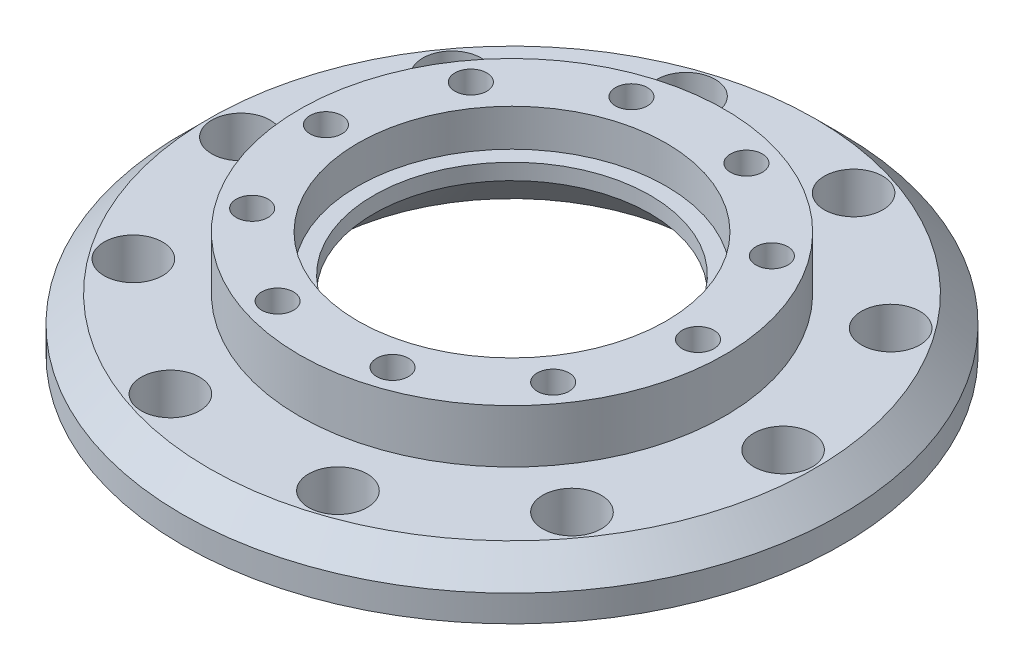
ISO-10303-21;
HEADER;
FILE_DESCRIPTION(('STEP AP214'),'2;1');
FILE_NAME('part.step','',(''),(''),'','','');
FILE_SCHEMA(('AUTOMOTIVE_DESIGN { 1 0 10303 214 1 1 1 1 }'));
ENDSEC;
DATA;
#1=APPLICATION_CONTEXT('core data for automotive mechanical design processes');
#2=APPLICATION_PROTOCOL_DEFINITION('international standard','automotive_design',2000,#1);
#3=PRODUCT_CONTEXT('',#1,'mechanical');
#4=PRODUCT('Part','Part','',(#3));
#5=PRODUCT_RELATED_PRODUCT_CATEGORY('part','',(#4));
#6=PRODUCT_DEFINITION_FORMATION('','',#4);
#7=PRODUCT_DEFINITION_CONTEXT('part definition',#1,'design');
#8=PRODUCT_DEFINITION('design','',#6,#7);
#9=PRODUCT_DEFINITION_SHAPE('','',#8);
#10=(LENGTH_UNIT() NAMED_UNIT(*) SI_UNIT(.MILLI.,.METRE.));
#11=(NAMED_UNIT(*) PLANE_ANGLE_UNIT() SI_UNIT($,.RADIAN.));
#12=(NAMED_UNIT(*) SI_UNIT($,.STERADIAN.) SOLID_ANGLE_UNIT());
#13=UNCERTAINTY_MEASURE_WITH_UNIT(LENGTH_MEASURE(1.E-05),#10,'distance_accuracy_value','');
#14=(GEOMETRIC_REPRESENTATION_CONTEXT(3) GLOBAL_UNCERTAINTY_ASSIGNED_CONTEXT((#13)) GLOBAL_UNIT_ASSIGNED_CONTEXT((#10,
#11,#12)) REPRESENTATION_CONTEXT('',''));
#15=CARTESIAN_POINT('',(0.,0.,0.));
#16=DIRECTION('',(0.,0.,1.));
#17=DIRECTION('',(1.,0.,0.));
#18=AXIS2_PLACEMENT_3D('',#15,#16,#17);
#19=CARTESIAN_POINT('',(0.,10.,0.));
#20=DIRECTION('',(0.,-1.,0.));
#21=DIRECTION('',(0.,0.,-1.));
#22=AXIS2_PLACEMENT_3D('',#19,#20,#21);
#23=CYLINDRICAL_SURFACE('',#22,29.);
#24=CARTESIAN_POINT('',(0.,20.,0.));
#25=DIRECTION('',(0.,1.,0.));
#26=DIRECTION('',(0.,0.,1.));
#27=AXIS2_PLACEMENT_3D('',#24,#25,#26);
#28=CIRCLE('',#27,29.);
#29=CARTESIAN_POINT('',(0.,20.,29.));
#30=VERTEX_POINT('',#29);
#31=EDGE_CURVE('E291',#30,#30,#28,.T.);
#32=ORIENTED_EDGE('',*,*,#31,.T.);
#33=EDGE_LOOP('',(#32));
#34=FACE_BOUND('',#33,.T.);
#35=CARTESIAN_POINT('',(0.,13.,0.));
#36=DIRECTION('',(0.,-1.,0.));
#37=DIRECTION('',(0.,0.,-1.));
#38=AXIS2_PLACEMENT_3D('',#35,#36,#37);
#39=CIRCLE('',#38,29.);
#40=CARTESIAN_POINT('',(0.,13.,-29.));
#41=VERTEX_POINT('',#40);
#42=EDGE_CURVE('E331',#41,#41,#39,.T.);
#43=ORIENTED_EDGE('',*,*,#42,.T.);
#44=EDGE_LOOP('',(#43));
#45=FACE_BOUND('',#44,.T.);
#46=ADVANCED_FACE('F105',(#34,#45),#23,.F.);
#47=CARTESIAN_POINT('',(0.,10.,0.));
#48=DIRECTION('',(0.,-1.,0.));
#49=DIRECTION('',(0.,0.,-1.));
#50=AXIS2_PLACEMENT_3D('',#47,#48,#49);
#51=CYLINDRICAL_SURFACE('',#50,62.);
#52=CARTESIAN_POINT('',(0.,4.99999999999999,0.));
#53=DIRECTION('',(0.,1.,0.));
#54=DIRECTION('',(0.,0.,1.));
#55=AXIS2_PLACEMENT_3D('',#52,#53,#54);
#56=CIRCLE('',#55,62.);
#57=CARTESIAN_POINT('',(0.,4.99999999999999,62.));
#58=VERTEX_POINT('',#57);
#59=EDGE_CURVE('E199',#58,#58,#56,.F.);
#60=ORIENTED_EDGE('',*,*,#59,.T.);
#61=EDGE_LOOP('',(#60));
#62=FACE_BOUND('',#61,.T.);
#63=CARTESIAN_POINT('',(0.,0.,0.));
#64=DIRECTION('',(0.,1.,0.));
#65=DIRECTION('',(0.,0.,1.));
#66=AXIS2_PLACEMENT_3D('',#63,#64,#65);
#67=CIRCLE('',#66,62.);
#68=CARTESIAN_POINT('',(0.,0.,62.));
#69=VERTEX_POINT('',#68);
#70=EDGE_CURVE('E248',#69,#69,#67,.T.);
#71=ORIENTED_EDGE('',*,*,#70,.T.);
#72=EDGE_LOOP('',(#71));
#73=FACE_BOUND('',#72,.T.);
#74=ADVANCED_FACE('F354',(#62,#73),#51,.T.);
#75=CARTESIAN_POINT('',(15.7598667131229,10.,-48.5038823310526));
#76=DIRECTION('',(0.,-1.,0.));
#77=DIRECTION('',(0.,0.,-1.));
#78=AXIS2_PLACEMENT_3D('',#75,#76,#77);
#79=CYLINDRICAL_SURFACE('',#78,5.50000000000001);
#80=CARTESIAN_POINT('',(15.7598667131229,1.00000000000001,-48.5038823310526));
#81=DIRECTION('',(0.,1.,0.));
#82=DIRECTION('',(0.,0.,1.));
#83=AXIS2_PLACEMENT_3D('',#80,#81,#82);
#84=CIRCLE('',#83,5.50000000000001);
#85=CARTESIAN_POINT('',(15.7598667131229,1.00000000000001,-43.0038823310526));
#86=VERTEX_POINT('',#85);
#87=EDGE_CURVE('E147',#86,#86,#84,.F.);
#88=ORIENTED_EDGE('',*,*,#87,.T.);
#89=EDGE_LOOP('',(#88));
#90=FACE_BOUND('',#89,.T.);
#91=CARTESIAN_POINT('',(15.7598667131229,10.,-48.5038823310526));
#92=DIRECTION('',(0.,1.,0.));
#93=DIRECTION('',(0.,0.,1.));
#94=AXIS2_PLACEMENT_3D('',#91,#92,#93);
#95=CIRCLE('',#94,5.50000000000001);
#96=CARTESIAN_POINT('',(15.7598667131229,10.,-43.0038823310526));
#97=VERTEX_POINT('',#96);
#98=EDGE_CURVE('E243',#97,#97,#95,.T.);
#99=ORIENTED_EDGE('',*,*,#98,.T.);
#100=EDGE_LOOP('',(#99));
#101=FACE_BOUND('',#100,.T.);
#102=ADVANCED_FACE('F360',(#90,#101),#79,.F.);
#103=CARTESIAN_POINT('',(-15.7598667131219,10.,-48.503882331053));
#104=DIRECTION('',(0.,-1.,0.));
#105=DIRECTION('',(0.,0.,-1.));
#106=AXIS2_PLACEMENT_3D('',#103,#104,#105);
#107=CYLINDRICAL_SURFACE('',#106,5.5);
#108=CARTESIAN_POINT('',(-15.7598667131219,0.999999999999978,-48.503882331053));
#109=DIRECTION('',(0.,1.,0.));
#110=DIRECTION('',(0.,0.,1.));
#111=AXIS2_PLACEMENT_3D('',#108,#109,#110);
#112=CIRCLE('',#111,5.5);
#113=CARTESIAN_POINT('',(-15.7598667131219,0.999999999999978,-43.003882331053));
#114=VERTEX_POINT('',#113);
#115=EDGE_CURVE('E143',#114,#114,#112,.F.);
#116=ORIENTED_EDGE('',*,*,#115,.T.);
#117=EDGE_LOOP('',(#116));
#118=FACE_BOUND('',#117,.T.);
#119=CARTESIAN_POINT('',(-15.7598667131219,10.,-48.503882331053));
#120=DIRECTION('',(0.,1.,0.));
#121=DIRECTION('',(0.,0.,1.));
#122=AXIS2_PLACEMENT_3D('',#119,#120,#121);
#123=CIRCLE('',#122,5.5);
#124=CARTESIAN_POINT('',(-15.7598667131219,10.,-43.003882331053));
#125=VERTEX_POINT('',#124);
#126=EDGE_CURVE('E256',#125,#125,#123,.T.);
#127=ORIENTED_EDGE('',*,*,#126,.T.);
#128=EDGE_LOOP('',(#127));
#129=FACE_BOUND('',#128,.T.);
#130=ADVANCED_FACE('F370',(#118,#129),#107,.F.);
#131=CARTESIAN_POINT('',(-41.259866713122,10.,-29.9770478669165));
#132=DIRECTION('',(0.,-1.,0.));
#133=DIRECTION('',(0.,0.,-1.));
#134=AXIS2_PLACEMENT_3D('',#131,#132,#133);
#135=CYLINDRICAL_SURFACE('',#134,5.49999999999999);
#136=CARTESIAN_POINT('',(-41.259866713122,0.999999999999982,-29.9770478669165));
#137=DIRECTION('',(0.,1.,0.));
#138=DIRECTION('',(0.,0.,1.));
#139=AXIS2_PLACEMENT_3D('',#136,#137,#138);
#140=CIRCLE('',#139,5.49999999999999);
#141=CARTESIAN_POINT('',(-41.259866713122,0.999999999999982,-24.4770478669165));
#142=VERTEX_POINT('',#141);
#143=EDGE_CURVE('E139',#142,#142,#140,.F.);
#144=ORIENTED_EDGE('',*,*,#143,.T.);
#145=EDGE_LOOP('',(#144));
#146=FACE_BOUND('',#145,.T.);
#147=CARTESIAN_POINT('',(-41.259866713122,10.,-29.9770478669165));
#148=DIRECTION('',(0.,1.,0.));
#149=DIRECTION('',(0.,0.,1.));
#150=AXIS2_PLACEMENT_3D('',#147,#148,#149);
#151=CIRCLE('',#150,5.49999999999999);
#152=CARTESIAN_POINT('',(-41.259866713122,10.,-24.4770478669165));
#153=VERTEX_POINT('',#152);
#154=EDGE_CURVE('E260',#153,#153,#151,.T.);
#155=ORIENTED_EDGE('',*,*,#154,.T.);
#156=EDGE_LOOP('',(#155));
#157=FACE_BOUND('',#156,.T.);
#158=ADVANCED_FACE('F374',(#146,#157),#135,.F.);
#159=CARTESIAN_POINT('',(-51.,10.,-3.56131096562E-13));
#160=DIRECTION('',(0.,-1.,0.));
#161=DIRECTION('',(0.,0.,-1.));
#162=AXIS2_PLACEMENT_3D('',#159,#160,#161);
#163=CYLINDRICAL_SURFACE('',#162,5.5);
#164=CARTESIAN_POINT('',(-51.,1.00000000000002,-3.56131096562E-13));
#165=DIRECTION('',(0.,1.,0.));
#166=DIRECTION('',(0.,0.,1.));
#167=AXIS2_PLACEMENT_3D('',#164,#165,#166);
#168=CIRCLE('',#167,5.5);
#169=CARTESIAN_POINT('',(-51.,1.00000000000002,5.49999999999964));
#170=VERTEX_POINT('',#169);
#171=EDGE_CURVE('E136',#170,#170,#168,.F.);
#172=ORIENTED_EDGE('',*,*,#171,.T.);
#173=EDGE_LOOP('',(#172));
#174=FACE_BOUND('',#173,.T.);
#175=CARTESIAN_POINT('',(-51.,10.,-3.56131096562E-13));
#176=DIRECTION('',(0.,1.,0.));
#177=DIRECTION('',(0.,0.,1.));
#178=AXIS2_PLACEMENT_3D('',#175,#176,#177);
#179=CIRCLE('',#178,5.5);
#180=CARTESIAN_POINT('',(-51.,10.,5.49999999999964));
#181=VERTEX_POINT('',#180);
#182=EDGE_CURVE('E264',#181,#181,#179,.T.);
#183=ORIENTED_EDGE('',*,*,#182,.T.);
#184=EDGE_LOOP('',(#183));
#185=FACE_BOUND('',#184,.T.);
#186=ADVANCED_FACE('F378',(#174,#185),#163,.F.);
#187=CARTESIAN_POINT('',(-41.2598667131225,10.,29.9770478669159));
#188=DIRECTION('',(0.,-1.,0.));
#189=DIRECTION('',(0.,0.,-1.));
#190=AXIS2_PLACEMENT_3D('',#187,#188,#189);
#191=CYLINDRICAL_SURFACE('',#190,5.5);
#192=CARTESIAN_POINT('',(-41.2598667131225,1.00000000000001,29.9770478669159));
#193=DIRECTION('',(0.,1.,0.));
#194=DIRECTION('',(0.,0.,1.));
#195=AXIS2_PLACEMENT_3D('',#192,#193,#194);
#196=CIRCLE('',#195,5.5);
#197=CARTESIAN_POINT('',(-41.2598667131225,1.00000000000001,35.4770478669159));
#198=VERTEX_POINT('',#197);
#199=EDGE_CURVE('E133',#198,#198,#196,.F.);
#200=ORIENTED_EDGE('',*,*,#199,.T.);
#201=EDGE_LOOP('',(#200));
#202=FACE_BOUND('',#201,.T.);
#203=CARTESIAN_POINT('',(-41.2598667131225,10.,29.9770478669159));
#204=DIRECTION('',(0.,1.,0.));
#205=DIRECTION('',(0.,0.,1.));
#206=AXIS2_PLACEMENT_3D('',#203,#204,#205);
#207=CIRCLE('',#206,5.5);
#208=CARTESIAN_POINT('',(-41.2598667131225,10.,35.4770478669159));
#209=VERTEX_POINT('',#208);
#210=EDGE_CURVE('E267',#209,#209,#207,.T.);
#211=ORIENTED_EDGE('',*,*,#210,.T.);
#212=EDGE_LOOP('',(#211));
#213=FACE_BOUND('',#212,.T.);
#214=ADVANCED_FACE('F382',(#202,#213),#191,.F.);
#215=CARTESIAN_POINT('',(-15.7598667131225,10.,48.5038823310528));
#216=DIRECTION('',(0.,-1.,0.));
#217=DIRECTION('',(0.,0.,-1.));
#218=AXIS2_PLACEMENT_3D('',#215,#216,#217);
#219=CYLINDRICAL_SURFACE('',#218,5.49999999999999);
#220=CARTESIAN_POINT('',(-15.7598667131225,0.999999999999982,48.5038823310528));
#221=DIRECTION('',(0.,1.,0.));
#222=DIRECTION('',(0.,0.,1.));
#223=AXIS2_PLACEMENT_3D('',#220,#221,#222);
#224=CIRCLE('',#223,5.49999999999999);
#225=CARTESIAN_POINT('',(-15.7598667131225,0.999999999999982,54.0038823310528));
#226=VERTEX_POINT('',#225);
#227=EDGE_CURVE('E128',#226,#226,#224,.F.);
#228=ORIENTED_EDGE('',*,*,#227,.T.);
#229=EDGE_LOOP('',(#228));
#230=FACE_BOUND('',#229,.T.);
#231=CARTESIAN_POINT('',(-15.7598667131225,10.,48.5038823310528));
#232=DIRECTION('',(0.,1.,0.));
#233=DIRECTION('',(0.,0.,1.));
#234=AXIS2_PLACEMENT_3D('',#231,#232,#233);
#235=CIRCLE('',#234,5.49999999999999);
#236=CARTESIAN_POINT('',(-15.7598667131225,10.,54.0038823310528));
#237=VERTEX_POINT('',#236);
#238=EDGE_CURVE('E270',#237,#237,#235,.T.);
#239=ORIENTED_EDGE('',*,*,#238,.T.);
#240=EDGE_LOOP('',(#239));
#241=FACE_BOUND('',#240,.T.);
#242=ADVANCED_FACE('F386',(#230,#241),#219,.F.);
#243=CARTESIAN_POINT('',(15.7598667131222,10.,48.5038823310529));
#244=DIRECTION('',(0.,-1.,0.));
#245=DIRECTION('',(0.,0.,-1.));
#246=AXIS2_PLACEMENT_3D('',#243,#244,#245);
#247=CYLINDRICAL_SURFACE('',#246,5.5);
#248=CARTESIAN_POINT('',(15.7598667131222,0.999999999999978,48.5038823310529));
#249=DIRECTION('',(0.,1.,0.));
#250=DIRECTION('',(0.,0.,1.));
#251=AXIS2_PLACEMENT_3D('',#248,#249,#250);
#252=CIRCLE('',#251,5.5);
#253=CARTESIAN_POINT('',(15.7598667131222,0.999999999999978,54.0038823310529));
#254=VERTEX_POINT('',#253);
#255=EDGE_CURVE('E121',#254,#254,#252,.F.);
#256=ORIENTED_EDGE('',*,*,#255,.T.);
#257=EDGE_LOOP('',(#256));
#258=FACE_BOUND('',#257,.T.);
#259=CARTESIAN_POINT('',(15.7598667131222,10.,48.5038823310529));
#260=DIRECTION('',(0.,1.,0.));
#261=DIRECTION('',(0.,0.,1.));
#262=AXIS2_PLACEMENT_3D('',#259,#260,#261);
#263=CIRCLE('',#262,5.5);
#264=CARTESIAN_POINT('',(15.7598667131222,10.,54.0038823310529));
#265=VERTEX_POINT('',#264);
#266=EDGE_CURVE('E273',#265,#265,#263,.T.);
#267=ORIENTED_EDGE('',*,*,#266,.T.);
#268=EDGE_LOOP('',(#267));
#269=FACE_BOUND('',#268,.T.);
#270=ADVANCED_FACE('F390',(#258,#269),#247,.F.);
#271=CARTESIAN_POINT('',(41.2598667131223,10.,29.9770478669162));
#272=DIRECTION('',(0.,-1.,0.));
#273=DIRECTION('',(0.,0.,-1.));
#274=AXIS2_PLACEMENT_3D('',#271,#272,#273);
#275=CYLINDRICAL_SURFACE('',#274,5.5);
#276=CARTESIAN_POINT('',(41.2598667131223,1.00000000000001,29.9770478669162));
#277=DIRECTION('',(0.,1.,0.));
#278=DIRECTION('',(0.,0.,1.));
#279=AXIS2_PLACEMENT_3D('',#276,#277,#278);
#280=CIRCLE('',#279,5.5);
#281=CARTESIAN_POINT('',(41.2598667131223,1.00000000000001,35.4770478669162));
#282=VERTEX_POINT('',#281);
#283=EDGE_CURVE('E158',#282,#282,#280,.F.);
#284=ORIENTED_EDGE('',*,*,#283,.T.);
#285=EDGE_LOOP('',(#284));
#286=FACE_BOUND('',#285,.T.);
#287=CARTESIAN_POINT('',(41.2598667131223,10.,29.9770478669162));
#288=DIRECTION('',(0.,1.,0.));
#289=DIRECTION('',(0.,0.,1.));
#290=AXIS2_PLACEMENT_3D('',#287,#288,#289);
#291=CIRCLE('',#290,5.5);
#292=CARTESIAN_POINT('',(41.2598667131223,10.,35.4770478669162));
#293=VERTEX_POINT('',#292);
#294=EDGE_CURVE('E277',#293,#293,#291,.T.);
#295=ORIENTED_EDGE('',*,*,#294,.T.);
#296=EDGE_LOOP('',(#295));
#297=FACE_BOUND('',#296,.T.);
#298=ADVANCED_FACE('F394',(#286,#297),#275,.F.);
#299=CARTESIAN_POINT('',(51.,10.,0.));
#300=DIRECTION('',(0.,-1.,0.));
#301=DIRECTION('',(0.,0.,-1.));
#302=AXIS2_PLACEMENT_3D('',#299,#300,#301);
#303=CYLINDRICAL_SURFACE('',#302,5.5);
#304=CARTESIAN_POINT('',(51.,1.00000000000002,0.));
#305=DIRECTION('',(0.,1.,0.));
#306=DIRECTION('',(0.,0.,1.));
#307=AXIS2_PLACEMENT_3D('',#304,#305,#306);
#308=CIRCLE('',#307,5.5);
#309=CARTESIAN_POINT('',(51.,1.00000000000002,5.5));
#310=VERTEX_POINT('',#309);
#311=EDGE_CURVE('E154',#310,#310,#308,.F.);
#312=ORIENTED_EDGE('',*,*,#311,.T.);
#313=EDGE_LOOP('',(#312));
#314=FACE_BOUND('',#313,.T.);
#315=CARTESIAN_POINT('',(51.,10.,0.));
#316=DIRECTION('',(0.,1.,0.));
#317=DIRECTION('',(0.,0.,1.));
#318=AXIS2_PLACEMENT_3D('',#315,#316,#317);
#319=CIRCLE('',#318,5.5);
#320=CARTESIAN_POINT('',(51.,10.,5.5));
#321=VERTEX_POINT('',#320);
#322=EDGE_CURVE('E281',#321,#321,#319,.T.);
#323=ORIENTED_EDGE('',*,*,#322,.T.);
#324=EDGE_LOOP('',(#323));
#325=FACE_BOUND('',#324,.T.);
#326=ADVANCED_FACE('F398',(#314,#325),#303,.F.);
#327=CARTESIAN_POINT('',(41.2598667131227,10.,-29.9770478669156));
#328=DIRECTION('',(0.,-1.,0.));
#329=DIRECTION('',(0.,0.,-1.));
#330=AXIS2_PLACEMENT_3D('',#327,#328,#329);
#331=CYLINDRICAL_SURFACE('',#330,5.49999999999999);
#332=CARTESIAN_POINT('',(41.2598667131227,0.999999999999982,-29.9770478669156));
#333=DIRECTION('',(0.,1.,0.));
#334=DIRECTION('',(0.,0.,1.));
#335=AXIS2_PLACEMENT_3D('',#332,#333,#334);
#336=CIRCLE('',#335,5.49999999999999);
#337=CARTESIAN_POINT('',(41.2598667131227,0.999999999999982,-24.4770478669156));
#338=VERTEX_POINT('',#337);
#339=EDGE_CURVE('E150',#338,#338,#336,.F.);
#340=ORIENTED_EDGE('',*,*,#339,.T.);
#341=EDGE_LOOP('',(#340));
#342=FACE_BOUND('',#341,.T.);
#343=CARTESIAN_POINT('',(41.2598667131227,10.,-29.9770478669156));
#344=DIRECTION('',(0.,1.,0.));
#345=DIRECTION('',(0.,0.,1.));
#346=AXIS2_PLACEMENT_3D('',#343,#344,#345);
#347=CIRCLE('',#346,5.49999999999999);
#348=CARTESIAN_POINT('',(41.2598667131227,10.,-24.4770478669156));
#349=VERTEX_POINT('',#348);
#350=EDGE_CURVE('E253',#349,#349,#347,.T.);
#351=ORIENTED_EDGE('',*,*,#350,.T.);
#352=EDGE_LOOP('',(#351));
#353=FACE_BOUND('',#352,.T.);
#354=ADVANCED_FACE('F402',(#342,#353),#331,.F.);
#355=CARTESIAN_POINT('',(0.,0.,0.));
#356=DIRECTION('',(0.,1.,0.));
#357=DIRECTION('',(0.,0.,1.));
#358=AXIS2_PLACEMENT_3D('',#355,#356,#357);
#359=PLANE('',#358);
#360=CARTESIAN_POINT('',(0.,0.,0.));
#361=DIRECTION('',(0.,1.,0.));
#362=DIRECTION('',(0.,0.,1.));
#363=AXIS2_PLACEMENT_3D('',#360,#361,#362);
#364=CIRCLE('',#363,36.0000000000001);
#365=CARTESIAN_POINT('',(0.,0.,36.0000000000001));
#366=VERTEX_POINT('',#365);
#367=EDGE_CURVE('E11',#366,#366,#364,.T.);
#368=ORIENTED_EDGE('',*,*,#367,.T.);
#369=EDGE_LOOP('',(#368));
#370=FACE_BOUND('',#369,.T.);
#371=CARTESIAN_POINT('',(41.2598667131223,0.,29.9770478669162));
#372=DIRECTION('',(0.,1.,0.));
#373=DIRECTION('',(0.,0.,1.));
#374=AXIS2_PLACEMENT_3D('',#371,#372,#373);
#375=CIRCLE('',#374,6.50000000000001);
#376=CARTESIAN_POINT('',(41.2598667131223,0.,36.4770478669162));
#377=VERTEX_POINT('',#376);
#378=EDGE_CURVE('E162',#377,#377,#375,.T.);
#379=ORIENTED_EDGE('',*,*,#378,.T.);
#380=EDGE_LOOP('',(#379));
#381=FACE_BOUND('',#380,.T.);
#382=CARTESIAN_POINT('',(51.,0.,0.));
#383=DIRECTION('',(0.,1.,0.));
#384=DIRECTION('',(0.,0.,1.));
#385=AXIS2_PLACEMENT_3D('',#382,#383,#384);
#386=CIRCLE('',#385,6.50000000000001);
#387=CARTESIAN_POINT('',(51.,0.,6.50000000000001));
#388=VERTEX_POINT('',#387);
#389=EDGE_CURVE('E166',#388,#388,#386,.T.);
#390=ORIENTED_EDGE('',*,*,#389,.T.);
#391=EDGE_LOOP('',(#390));
#392=FACE_BOUND('',#391,.T.);
#393=CARTESIAN_POINT('',(41.2598667131227,0.,-29.9770478669156));
#394=DIRECTION('',(0.,1.,0.));
#395=DIRECTION('',(0.,0.,1.));
#396=AXIS2_PLACEMENT_3D('',#393,#394,#395);
#397=CIRCLE('',#396,6.49999999999998);
#398=CARTESIAN_POINT('',(41.2598667131227,0.,-23.4770478669156));
#399=VERTEX_POINT('',#398);
#400=EDGE_CURVE('E170',#399,#399,#397,.T.);
#401=ORIENTED_EDGE('',*,*,#400,.T.);
#402=EDGE_LOOP('',(#401));
#403=FACE_BOUND('',#402,.T.);
#404=CARTESIAN_POINT('',(15.7598667131229,0.,-48.5038823310526));
#405=DIRECTION('',(0.,1.,0.));
#406=DIRECTION('',(0.,0.,1.));
#407=AXIS2_PLACEMENT_3D('',#404,#405,#406);
#408=CIRCLE('',#407,6.50000000000001);
#409=CARTESIAN_POINT('',(15.7598667131229,0.,-42.0038823310526));
#410=VERTEX_POINT('',#409);
#411=EDGE_CURVE('E174',#410,#410,#408,.T.);
#412=ORIENTED_EDGE('',*,*,#411,.T.);
#413=EDGE_LOOP('',(#412));
#414=FACE_BOUND('',#413,.T.);
#415=CARTESIAN_POINT('',(-15.7598667131219,0.,-48.503882331053));
#416=DIRECTION('',(0.,1.,0.));
#417=DIRECTION('',(0.,0.,1.));
#418=AXIS2_PLACEMENT_3D('',#415,#416,#417);
#419=CIRCLE('',#418,6.49999999999998);
#420=CARTESIAN_POINT('',(-15.7598667131219,0.,-42.003882331053));
#421=VERTEX_POINT('',#420);
#422=EDGE_CURVE('E178',#421,#421,#419,.T.);
#423=ORIENTED_EDGE('',*,*,#422,.T.);
#424=EDGE_LOOP('',(#423));
#425=FACE_BOUND('',#424,.T.);
#426=CARTESIAN_POINT('',(-41.259866713122,0.,-29.9770478669165));
#427=DIRECTION('',(0.,1.,0.));
#428=DIRECTION('',(0.,0.,1.));
#429=AXIS2_PLACEMENT_3D('',#426,#427,#428);
#430=CIRCLE('',#429,6.49999999999998);
#431=CARTESIAN_POINT('',(-41.259866713122,0.,-23.4770478669165));
#432=VERTEX_POINT('',#431);
#433=EDGE_CURVE('E182',#432,#432,#430,.T.);
#434=ORIENTED_EDGE('',*,*,#433,.T.);
#435=EDGE_LOOP('',(#434));
#436=FACE_BOUND('',#435,.T.);
#437=CARTESIAN_POINT('',(-51.,0.,-3.56131096562E-13));
#438=DIRECTION('',(0.,1.,0.));
#439=DIRECTION('',(0.,0.,1.));
#440=AXIS2_PLACEMENT_3D('',#437,#438,#439);
#441=CIRCLE('',#440,6.50000000000001);
#442=CARTESIAN_POINT('',(-51.,0.,6.49999999999965));
#443=VERTEX_POINT('',#442);
#444=EDGE_CURVE('E186',#443,#443,#441,.T.);
#445=ORIENTED_EDGE('',*,*,#444,.T.);
#446=EDGE_LOOP('',(#445));
#447=FACE_BOUND('',#446,.T.);
#448=CARTESIAN_POINT('',(-41.2598667131225,0.,29.9770478669159));
#449=DIRECTION('',(0.,1.,0.));
#450=DIRECTION('',(0.,0.,1.));
#451=AXIS2_PLACEMENT_3D('',#448,#449,#450);
#452=CIRCLE('',#451,6.50000000000001);
#453=CARTESIAN_POINT('',(-41.2598667131225,0.,36.4770478669159));
#454=VERTEX_POINT('',#453);
#455=EDGE_CURVE('E189',#454,#454,#452,.T.);
#456=ORIENTED_EDGE('',*,*,#455,.T.);
#457=EDGE_LOOP('',(#456));
#458=FACE_BOUND('',#457,.T.);
#459=CARTESIAN_POINT('',(-15.7598667131225,0.,48.5038823310528));
#460=DIRECTION('',(0.,1.,0.));
#461=DIRECTION('',(0.,0.,1.));
#462=AXIS2_PLACEMENT_3D('',#459,#460,#461);
#463=CIRCLE('',#462,6.49999999999998);
#464=CARTESIAN_POINT('',(-15.7598667131225,0.,55.0038823310528));
#465=VERTEX_POINT('',#464);
#466=EDGE_CURVE('E192',#465,#465,#463,.T.);
#467=ORIENTED_EDGE('',*,*,#466,.T.);
#468=EDGE_LOOP('',(#467));
#469=FACE_BOUND('',#468,.T.);
#470=CARTESIAN_POINT('',(15.7598667131222,0.,48.5038823310529));
#471=DIRECTION('',(0.,1.,0.));
#472=DIRECTION('',(0.,0.,1.));
#473=AXIS2_PLACEMENT_3D('',#470,#471,#472);
#474=CIRCLE('',#473,6.49999999999998);
#475=CARTESIAN_POINT('',(15.7598667131222,0.,55.0038823310529));
#476=VERTEX_POINT('',#475);
#477=EDGE_CURVE('E195',#476,#476,#474,.T.);
#478=ORIENTED_EDGE('',*,*,#477,.T.);
#479=EDGE_LOOP('',(#478));
#480=FACE_BOUND('',#479,.T.);
#481=ORIENTED_EDGE('',*,*,#70,.F.);
#482=EDGE_LOOP('',(#481));
#483=FACE_BOUND('',#482,.T.);
#484=ADVANCED_FACE('F365',(#370,#381,#392,#403,#414,#425,#436,#447,#458,#469,#480,#483),#359,.F.);
#485=CARTESIAN_POINT('',(0.,10.,0.));
#486=DIRECTION('',(0.,1.,0.));
#487=DIRECTION('',(0.,0.,1.));
#488=AXIS2_PLACEMENT_3D('',#485,#486,#487);
#489=PLANE('',#488);
#490=CARTESIAN_POINT('',(0.,10.,0.));
#491=DIRECTION('',(0.,1.,0.));
#492=DIRECTION('',(0.,0.,1.));
#493=AXIS2_PLACEMENT_3D('',#490,#491,#492);
#494=CIRCLE('',#493,57.);
#495=CARTESIAN_POINT('',(0.,10.,57.));
#496=VERTEX_POINT('',#495);
#497=EDGE_CURVE('E203',#496,#496,#494,.T.);
#498=ORIENTED_EDGE('',*,*,#497,.T.);
#499=EDGE_LOOP('',(#498));
#500=FACE_BOUND('',#499,.T.);
#501=CARTESIAN_POINT('',(0.,10.,0.));
#502=DIRECTION('',(0.,1.,0.));
#503=DIRECTION('',(0.,0.,1.));
#504=AXIS2_PLACEMENT_3D('',#501,#502,#503);
#505=CIRCLE('',#504,40.);
#506=CARTESIAN_POINT('',(0.,10.,40.));
#507=VERTEX_POINT('',#506);
#508=EDGE_CURVE('E244',#507,#507,#505,.F.);
#509=ORIENTED_EDGE('',*,*,#508,.T.);
#510=EDGE_LOOP('',(#509));
#511=FACE_BOUND('',#510,.T.);
#512=ORIENTED_EDGE('',*,*,#350,.F.);
#513=EDGE_LOOP('',(#512));
#514=FACE_BOUND('',#513,.T.);
#515=ORIENTED_EDGE('',*,*,#322,.F.);
#516=EDGE_LOOP('',(#515));
#517=FACE_BOUND('',#516,.T.);
#518=ORIENTED_EDGE('',*,*,#294,.F.);
#519=EDGE_LOOP('',(#518));
#520=FACE_BOUND('',#519,.T.);
#521=ORIENTED_EDGE('',*,*,#266,.F.);
#522=EDGE_LOOP('',(#521));
#523=FACE_BOUND('',#522,.T.);
#524=ORIENTED_EDGE('',*,*,#238,.F.);
#525=EDGE_LOOP('',(#524));
#526=FACE_BOUND('',#525,.T.);
#527=ORIENTED_EDGE('',*,*,#210,.F.);
#528=EDGE_LOOP('',(#527));
#529=FACE_BOUND('',#528,.T.);
#530=ORIENTED_EDGE('',*,*,#182,.F.);
#531=EDGE_LOOP('',(#530));
#532=FACE_BOUND('',#531,.T.);
#533=ORIENTED_EDGE('',*,*,#154,.F.);
#534=EDGE_LOOP('',(#533));
#535=FACE_BOUND('',#534,.T.);
#536=ORIENTED_EDGE('',*,*,#126,.F.);
#537=EDGE_LOOP('',(#536));
#538=FACE_BOUND('',#537,.T.);
#539=ORIENTED_EDGE('',*,*,#98,.F.);
#540=EDGE_LOOP('',(#539));
#541=FACE_BOUND('',#540,.T.);
#542=ADVANCED_FACE('F490',(#500,#511,#514,#517,#520,#523,#526,#529,#532,#535,#538,#541),#489,.T.);
#543=CARTESIAN_POINT('',(35.,20.,0.));
#544=DIRECTION('',(0.,-1.,0.));
#545=DIRECTION('',(0.,0.,-1.));
#546=AXIS2_PLACEMENT_3D('',#543,#544,#545);
#547=CYLINDRICAL_SURFACE('',#546,3.);
#548=CARTESIAN_POINT('',(35.,15.,0.));
#549=DIRECTION('',(0.,1.,0.));
#550=DIRECTION('',(0.,0.,1.));
#551=AXIS2_PLACEMENT_3D('',#548,#549,#550);
#552=CIRCLE('',#551,3.);
#553=CARTESIAN_POINT('',(35.,15.,3.));
#554=VERTEX_POINT('',#553);
#555=EDGE_CURVE('E218',#554,#554,#552,.T.);
#556=ORIENTED_EDGE('',*,*,#555,.F.);
#557=EDGE_LOOP('',(#556));
#558=FACE_BOUND('',#557,.T.);
#559=CARTESIAN_POINT('',(35.,20.,0.));
#560=DIRECTION('',(0.,1.,0.));
#561=DIRECTION('',(0.,0.,1.));
#562=AXIS2_PLACEMENT_3D('',#559,#560,#561);
#563=CIRCLE('',#562,3.);
#564=CARTESIAN_POINT('',(35.,20.,3.));
#565=VERTEX_POINT('',#564);
#566=EDGE_CURVE('E295',#565,#565,#563,.T.);
#567=ORIENTED_EDGE('',*,*,#566,.T.);
#568=EDGE_LOOP('',(#567));
#569=FACE_BOUND('',#568,.T.);
#570=ADVANCED_FACE('F496',(#558,#569),#547,.F.);
#571=CARTESIAN_POINT('',(28.3155948031231,20.,20.5724838302366));
#572=DIRECTION('',(0.,-1.,0.));
#573=DIRECTION('',(0.,0.,-1.));
#574=AXIS2_PLACEMENT_3D('',#571,#572,#573);
#575=CYLINDRICAL_SURFACE('',#574,3.);
#576=CARTESIAN_POINT('',(28.3155948031231,15.,20.5724838302366));
#577=DIRECTION('',(0.,1.,0.));
#578=DIRECTION('',(0.,0.,1.));
#579=AXIS2_PLACEMENT_3D('',#576,#577,#578);
#580=CIRCLE('',#579,3.);
#581=CARTESIAN_POINT('',(28.3155948031231,15.,23.5724838302366));
#582=VERTEX_POINT('',#581);
#583=EDGE_CURVE('E214',#582,#582,#580,.T.);
#584=ORIENTED_EDGE('',*,*,#583,.F.);
#585=EDGE_LOOP('',(#584));
#586=FACE_BOUND('',#585,.T.);
#587=CARTESIAN_POINT('',(28.3155948031231,20.,20.5724838302366));
#588=DIRECTION('',(0.,1.,0.));
#589=DIRECTION('',(0.,0.,1.));
#590=AXIS2_PLACEMENT_3D('',#587,#588,#589);
#591=CIRCLE('',#590,3.);
#592=CARTESIAN_POINT('',(28.3155948031231,20.,23.5724838302366));
#593=VERTEX_POINT('',#592);
#594=EDGE_CURVE('E299',#593,#593,#591,.T.);
#595=ORIENTED_EDGE('',*,*,#594,.T.);
#596=EDGE_LOOP('',(#595));
#597=FACE_BOUND('',#596,.T.);
#598=ADVANCED_FACE('F528',(#586,#597),#575,.F.);
#599=CARTESIAN_POINT('',(10.8155948031231,20.,33.2869780703304));
#600=DIRECTION('',(0.,-1.,0.));
#601=DIRECTION('',(0.,0.,-1.));
#602=AXIS2_PLACEMENT_3D('',#599,#600,#601);
#603=CYLINDRICAL_SURFACE('',#602,3.00000000000001);
#604=CARTESIAN_POINT('',(10.8155948031231,15.,33.2869780703304));
#605=DIRECTION('',(0.,1.,0.));
#606=DIRECTION('',(0.,0.,1.));
#607=AXIS2_PLACEMENT_3D('',#604,#605,#606);
#608=CIRCLE('',#607,3.00000000000001);
#609=CARTESIAN_POINT('',(10.8155948031231,15.,36.2869780703304));
#610=VERTEX_POINT('',#609);
#611=EDGE_CURVE('E210',#610,#610,#608,.T.);
#612=ORIENTED_EDGE('',*,*,#611,.F.);
#613=EDGE_LOOP('',(#612));
#614=FACE_BOUND('',#613,.T.);
#615=CARTESIAN_POINT('',(10.8155948031231,20.,33.2869780703304));
#616=DIRECTION('',(0.,1.,0.));
#617=DIRECTION('',(0.,0.,1.));
#618=AXIS2_PLACEMENT_3D('',#615,#616,#617);
#619=CIRCLE('',#618,3.00000000000001);
#620=CARTESIAN_POINT('',(10.8155948031231,20.,36.2869780703304));
#621=VERTEX_POINT('',#620);
#622=EDGE_CURVE('E303',#621,#621,#619,.T.);
#623=ORIENTED_EDGE('',*,*,#622,.T.);
#624=EDGE_LOOP('',(#623));
#625=FACE_BOUND('',#624,.T.);
#626=ADVANCED_FACE('F561',(#614,#625),#603,.F.);
#627=CARTESIAN_POINT('',(-10.8155948031233,20.,33.2869780703303));
#628=DIRECTION('',(0.,-1.,0.));
#629=DIRECTION('',(0.,0.,-1.));
#630=AXIS2_PLACEMENT_3D('',#627,#628,#629);
#631=CYLINDRICAL_SURFACE('',#630,3.);
#632=CARTESIAN_POINT('',(-10.8155948031233,15.,33.2869780703303));
#633=DIRECTION('',(0.,1.,0.));
#634=DIRECTION('',(0.,0.,1.));
#635=AXIS2_PLACEMENT_3D('',#632,#633,#634);
#636=CIRCLE('',#635,3.);
#637=CARTESIAN_POINT('',(-10.8155948031233,15.,36.2869780703303));
#638=VERTEX_POINT('',#637);
#639=EDGE_CURVE('E207',#638,#638,#636,.T.);
#640=ORIENTED_EDGE('',*,*,#639,.F.);
#641=EDGE_LOOP('',(#640));
#642=FACE_BOUND('',#641,.T.);
#643=CARTESIAN_POINT('',(-10.8155948031233,20.,33.2869780703303));
#644=DIRECTION('',(0.,1.,0.));
#645=DIRECTION('',(0.,0.,1.));
#646=AXIS2_PLACEMENT_3D('',#643,#644,#645);
#647=CIRCLE('',#646,3.);
#648=CARTESIAN_POINT('',(-10.8155948031233,20.,36.2869780703303));
#649=VERTEX_POINT('',#648);
#650=EDGE_CURVE('E307',#649,#649,#647,.T.);
#651=ORIENTED_EDGE('',*,*,#650,.T.);
#652=EDGE_LOOP('',(#651));
#653=FACE_BOUND('',#652,.T.);
#654=ADVANCED_FACE('F557',(#642,#653),#631,.F.);
#655=CARTESIAN_POINT('',(-28.3155948031233,20.,20.5724838302364));
#656=DIRECTION('',(0.,-1.,0.));
#657=DIRECTION('',(0.,0.,-1.));
#658=AXIS2_PLACEMENT_3D('',#655,#656,#657);
#659=CYLINDRICAL_SURFACE('',#658,3.);
#660=CARTESIAN_POINT('',(-28.3155948031233,15.,20.5724838302364));
#661=DIRECTION('',(0.,1.,0.));
#662=DIRECTION('',(0.,0.,1.));
#663=AXIS2_PLACEMENT_3D('',#660,#661,#662);
#664=CIRCLE('',#663,3.);
#665=CARTESIAN_POINT('',(-28.3155948031233,15.,23.5724838302364));
#666=VERTEX_POINT('',#665);
#667=EDGE_CURVE('E240',#666,#666,#664,.T.);
#668=ORIENTED_EDGE('',*,*,#667,.F.);
#669=EDGE_LOOP('',(#668));
#670=FACE_BOUND('',#669,.T.);
#671=CARTESIAN_POINT('',(-28.3155948031233,20.,20.5724838302364));
#672=DIRECTION('',(0.,1.,0.));
#673=DIRECTION('',(0.,0.,1.));
#674=AXIS2_PLACEMENT_3D('',#671,#672,#673);
#675=CIRCLE('',#674,3.);
#676=CARTESIAN_POINT('',(-28.3155948031233,20.,23.5724838302364));
#677=VERTEX_POINT('',#676);
#678=EDGE_CURVE('E310',#677,#677,#675,.T.);
#679=ORIENTED_EDGE('',*,*,#678,.T.);
#680=EDGE_LOOP('',(#679));
#681=FACE_BOUND('',#680,.T.);
#682=ADVANCED_FACE('F553',(#670,#681),#659,.F.);
#683=CARTESIAN_POINT('',(-35.,20.,-2.44403693719019E-13));
#684=DIRECTION('',(0.,-1.,0.));
#685=DIRECTION('',(0.,0.,-1.));
#686=AXIS2_PLACEMENT_3D('',#683,#684,#685);
#687=CYLINDRICAL_SURFACE('',#686,3.);
#688=CARTESIAN_POINT('',(-35.,15.,-2.44403693719019E-13));
#689=DIRECTION('',(0.,1.,0.));
#690=DIRECTION('',(0.,0.,1.));
#691=AXIS2_PLACEMENT_3D('',#688,#689,#690);
#692=CIRCLE('',#691,3.);
#693=CARTESIAN_POINT('',(-35.,15.,2.99999999999976));
#694=VERTEX_POINT('',#693);
#695=EDGE_CURVE('E237',#694,#694,#692,.T.);
#696=ORIENTED_EDGE('',*,*,#695,.F.);
#697=EDGE_LOOP('',(#696));
#698=FACE_BOUND('',#697,.T.);
#699=CARTESIAN_POINT('',(-35.,20.,-2.44403693719019E-13));
#700=DIRECTION('',(0.,1.,0.));
#701=DIRECTION('',(0.,0.,1.));
#702=AXIS2_PLACEMENT_3D('',#699,#700,#701);
#703=CIRCLE('',#702,3.);
#704=CARTESIAN_POINT('',(-35.,20.,2.99999999999976));
#705=VERTEX_POINT('',#704);
#706=EDGE_CURVE('E313',#705,#705,#703,.T.);
#707=ORIENTED_EDGE('',*,*,#706,.T.);
#708=EDGE_LOOP('',(#707));
#709=FACE_BOUND('',#708,.T.);
#710=ADVANCED_FACE('F549',(#698,#709),#687,.F.);
#711=CARTESIAN_POINT('',(-28.315594803123,20.,-20.5724838302368));
#712=DIRECTION('',(0.,-1.,0.));
#713=DIRECTION('',(0.,0.,-1.));
#714=AXIS2_PLACEMENT_3D('',#711,#712,#713);
#715=CYLINDRICAL_SURFACE('',#714,3.);
#716=CARTESIAN_POINT('',(-28.315594803123,15.,-20.5724838302368));
#717=DIRECTION('',(0.,1.,0.));
#718=DIRECTION('',(0.,0.,1.));
#719=AXIS2_PLACEMENT_3D('',#716,#717,#718);
#720=CIRCLE('',#719,3.);
#721=CARTESIAN_POINT('',(-28.315594803123,15.,-17.5724838302368));
#722=VERTEX_POINT('',#721);
#723=EDGE_CURVE('E233',#722,#722,#720,.T.);
#724=ORIENTED_EDGE('',*,*,#723,.F.);
#725=EDGE_LOOP('',(#724));
#726=FACE_BOUND('',#725,.T.);
#727=CARTESIAN_POINT('',(-28.315594803123,20.,-20.5724838302368));
#728=DIRECTION('',(0.,1.,0.));
#729=DIRECTION('',(0.,0.,1.));
#730=AXIS2_PLACEMENT_3D('',#727,#728,#729);
#731=CIRCLE('',#730,3.);
#732=CARTESIAN_POINT('',(-28.315594803123,20.,-17.5724838302368));
#733=VERTEX_POINT('',#732);
#734=EDGE_CURVE('E316',#733,#733,#731,.T.);
#735=ORIENTED_EDGE('',*,*,#734,.T.);
#736=EDGE_LOOP('',(#735));
#737=FACE_BOUND('',#736,.T.);
#738=ADVANCED_FACE('F545',(#726,#737),#715,.F.);
#739=CARTESIAN_POINT('',(-10.8155948031228,20.,-33.2869780703305));
#740=DIRECTION('',(0.,-1.,0.));
#741=DIRECTION('',(0.,0.,-1.));
#742=AXIS2_PLACEMENT_3D('',#739,#740,#741);
#743=CYLINDRICAL_SURFACE('',#742,3.);
#744=CARTESIAN_POINT('',(-10.8155948031228,15.,-33.2869780703305));
#745=DIRECTION('',(0.,1.,0.));
#746=DIRECTION('',(0.,0.,1.));
#747=AXIS2_PLACEMENT_3D('',#744,#745,#746);
#748=CIRCLE('',#747,3.);
#749=CARTESIAN_POINT('',(-10.8155948031228,15.,-30.2869780703305));
#750=VERTEX_POINT('',#749);
#751=EDGE_CURVE('E229',#750,#750,#748,.T.);
#752=ORIENTED_EDGE('',*,*,#751,.F.);
#753=EDGE_LOOP('',(#752));
#754=FACE_BOUND('',#753,.T.);
#755=CARTESIAN_POINT('',(-10.8155948031228,20.,-33.2869780703305));
#756=DIRECTION('',(0.,1.,0.));
#757=DIRECTION('',(0.,0.,1.));
#758=AXIS2_PLACEMENT_3D('',#755,#756,#757);
#759=CIRCLE('',#758,3.);
#760=CARTESIAN_POINT('',(-10.8155948031228,20.,-30.2869780703305));
#761=VERTEX_POINT('',#760);
#762=EDGE_CURVE('E320',#761,#761,#759,.T.);
#763=ORIENTED_EDGE('',*,*,#762,.T.);
#764=EDGE_LOOP('',(#763));
#765=FACE_BOUND('',#764,.T.);
#766=ADVANCED_FACE('F541',(#754,#765),#743,.F.);
#767=CARTESIAN_POINT('',(10.8155948031235,20.,-33.2869780703303));
#768=DIRECTION('',(0.,-1.,0.));
#769=DIRECTION('',(0.,0.,-1.));
#770=AXIS2_PLACEMENT_3D('',#767,#768,#769);
#771=CYLINDRICAL_SURFACE('',#770,3.);
#772=CARTESIAN_POINT('',(10.8155948031235,15.,-33.2869780703303));
#773=DIRECTION('',(0.,1.,0.));
#774=DIRECTION('',(0.,0.,1.));
#775=AXIS2_PLACEMENT_3D('',#772,#773,#774);
#776=CIRCLE('',#775,3.);
#777=CARTESIAN_POINT('',(10.8155948031235,15.,-30.2869780703303));
#778=VERTEX_POINT('',#777);
#779=EDGE_CURVE('E226',#778,#778,#776,.T.);
#780=ORIENTED_EDGE('',*,*,#779,.F.);
#781=EDGE_LOOP('',(#780));
#782=FACE_BOUND('',#781,.T.);
#783=CARTESIAN_POINT('',(10.8155948031235,20.,-33.2869780703303));
#784=DIRECTION('',(0.,1.,0.));
#785=DIRECTION('',(0.,0.,1.));
#786=AXIS2_PLACEMENT_3D('',#783,#784,#785);
#787=CIRCLE('',#786,3.);
#788=CARTESIAN_POINT('',(10.8155948031235,20.,-30.2869780703303));
#789=VERTEX_POINT('',#788);
#790=EDGE_CURVE('E324',#789,#789,#787,.T.);
#791=ORIENTED_EDGE('',*,*,#790,.T.);
#792=EDGE_LOOP('',(#791));
#793=FACE_BOUND('',#792,.T.);
#794=ADVANCED_FACE('F537',(#782,#793),#771,.F.);
#795=CARTESIAN_POINT('',(28.3155948031234,20.,-20.5724838302362));
#796=DIRECTION('',(0.,-1.,0.));
#797=DIRECTION('',(0.,0.,-1.));
#798=AXIS2_PLACEMENT_3D('',#795,#796,#797);
#799=CYLINDRICAL_SURFACE('',#798,3.);
#800=CARTESIAN_POINT('',(28.3155948031234,15.,-20.5724838302362));
#801=DIRECTION('',(0.,1.,0.));
#802=DIRECTION('',(0.,0.,1.));
#803=AXIS2_PLACEMENT_3D('',#800,#801,#802);
#804=CIRCLE('',#803,3.);
#805=CARTESIAN_POINT('',(28.3155948031234,15.,-17.5724838302362));
#806=VERTEX_POINT('',#805);
#807=EDGE_CURVE('E222',#806,#806,#804,.T.);
#808=ORIENTED_EDGE('',*,*,#807,.F.);
#809=EDGE_LOOP('',(#808));
#810=FACE_BOUND('',#809,.T.);
#811=CARTESIAN_POINT('',(28.3155948031234,20.,-20.5724838302362));
#812=DIRECTION('',(0.,1.,0.));
#813=DIRECTION('',(0.,0.,1.));
#814=AXIS2_PLACEMENT_3D('',#811,#812,#813);
#815=CIRCLE('',#814,3.);
#816=CARTESIAN_POINT('',(28.3155948031234,20.,-17.5724838302362));
#817=VERTEX_POINT('',#816);
#818=EDGE_CURVE('E327',#817,#817,#815,.T.);
#819=ORIENTED_EDGE('',*,*,#818,.T.);
#820=EDGE_LOOP('',(#819));
#821=FACE_BOUND('',#820,.T.);
#822=ADVANCED_FACE('F533',(#810,#821),#799,.F.);
#823=CARTESIAN_POINT('',(0.,20.,0.));
#824=DIRECTION('',(0.,-1.,0.));
#825=DIRECTION('',(0.,0.,-1.));
#826=AXIS2_PLACEMENT_3D('',#823,#824,#825);
#827=CYLINDRICAL_SURFACE('',#826,40.);
#828=ORIENTED_EDGE('',*,*,#508,.F.);
#829=EDGE_LOOP('',(#828));
#830=FACE_BOUND('',#829,.T.);
#831=CARTESIAN_POINT('',(0.,20.,0.));
#832=DIRECTION('',(0.,1.,0.));
#833=DIRECTION('',(0.,0.,1.));
#834=AXIS2_PLACEMENT_3D('',#831,#832,#833);
#835=CIRCLE('',#834,40.);
#836=CARTESIAN_POINT('',(0.,20.,40.));
#837=VERTEX_POINT('',#836);
#838=EDGE_CURVE('E249',#837,#837,#835,.T.);
#839=ORIENTED_EDGE('',*,*,#838,.F.);
#840=EDGE_LOOP('',(#839));
#841=FACE_BOUND('',#840,.T.);
#842=ADVANCED_FACE('F536',(#830,#841),#827,.T.);
#843=CARTESIAN_POINT('',(0.,20.,0.));
#844=DIRECTION('',(0.,1.,0.));
#845=DIRECTION('',(0.,0.,1.));
#846=AXIS2_PLACEMENT_3D('',#843,#844,#845);
#847=PLANE('',#846);
#848=ORIENTED_EDGE('',*,*,#818,.F.);
#849=EDGE_LOOP('',(#848));
#850=FACE_BOUND('',#849,.T.);
#851=ORIENTED_EDGE('',*,*,#790,.F.);
#852=EDGE_LOOP('',(#851));
#853=FACE_BOUND('',#852,.T.);
#854=ORIENTED_EDGE('',*,*,#762,.F.);
#855=EDGE_LOOP('',(#854));
#856=FACE_BOUND('',#855,.T.);
#857=ORIENTED_EDGE('',*,*,#734,.F.);
#858=EDGE_LOOP('',(#857));
#859=FACE_BOUND('',#858,.T.);
#860=ORIENTED_EDGE('',*,*,#706,.F.);
#861=EDGE_LOOP('',(#860));
#862=FACE_BOUND('',#861,.T.);
#863=ORIENTED_EDGE('',*,*,#678,.F.);
#864=EDGE_LOOP('',(#863));
#865=FACE_BOUND('',#864,.T.);
#866=ORIENTED_EDGE('',*,*,#650,.F.);
#867=EDGE_LOOP('',(#866));
#868=FACE_BOUND('',#867,.T.);
#869=ORIENTED_EDGE('',*,*,#622,.F.);
#870=EDGE_LOOP('',(#869));
#871=FACE_BOUND('',#870,.T.);
#872=ORIENTED_EDGE('',*,*,#594,.F.);
#873=EDGE_LOOP('',(#872));
#874=FACE_BOUND('',#873,.T.);
#875=ORIENTED_EDGE('',*,*,#566,.F.);
#876=EDGE_LOOP('',(#875));
#877=FACE_BOUND('',#876,.T.);
#878=ORIENTED_EDGE('',*,*,#31,.F.);
#879=EDGE_LOOP('',(#878));
#880=FACE_BOUND('',#879,.T.);
#881=ORIENTED_EDGE('',*,*,#838,.T.);
#882=EDGE_LOOP('',(#881));
#883=FACE_BOUND('',#882,.T.);
#884=ADVANCED_FACE('F571',(#850,#853,#856,#859,#862,#865,#868,#871,#874,#877,#880,#883),#847,.T.);
#885=CARTESIAN_POINT('',(-28.3155948031233,15.,20.5724838302364));
#886=DIRECTION('',(0.,1.,0.));
#887=DIRECTION('',(0.,0.,1.));
#888=AXIS2_PLACEMENT_3D('',#885,#886,#887);
#889=PLANE('',#888);
#890=ORIENTED_EDGE('',*,*,#667,.T.);
#891=EDGE_LOOP('',(#890));
#892=FACE_BOUND('',#891,.T.);
#893=ADVANCED_FACE('F575',(#892),#889,.T.);
#894=CARTESIAN_POINT('',(-35.,15.,-2.39391839684799E-13));
#895=DIRECTION('',(0.,1.,0.));
#896=DIRECTION('',(0.,0.,1.));
#897=AXIS2_PLACEMENT_3D('',#894,#895,#896);
#898=PLANE('',#897);
#899=ORIENTED_EDGE('',*,*,#695,.T.);
#900=EDGE_LOOP('',(#899));
#901=FACE_BOUND('',#900,.T.);
#902=ADVANCED_FACE('F579',(#901),#898,.T.);
#903=CARTESIAN_POINT('',(-28.315594803123,15.,-20.5724838302368));
#904=DIRECTION('',(0.,1.,0.));
#905=DIRECTION('',(0.,0.,1.));
#906=AXIS2_PLACEMENT_3D('',#903,#904,#905);
#907=PLANE('',#906);
#908=ORIENTED_EDGE('',*,*,#723,.T.);
#909=EDGE_LOOP('',(#908));
#910=FACE_BOUND('',#909,.T.);
#911=ADVANCED_FACE('F583',(#910),#907,.T.);
#912=CARTESIAN_POINT('',(-10.8155948031228,15.,-33.2869780703305));
#913=DIRECTION('',(0.,1.,0.));
#914=DIRECTION('',(0.,0.,1.));
#915=AXIS2_PLACEMENT_3D('',#912,#913,#914);
#916=PLANE('',#915);
#917=ORIENTED_EDGE('',*,*,#751,.T.);
#918=EDGE_LOOP('',(#917));
#919=FACE_BOUND('',#918,.T.);
#920=ADVANCED_FACE('F587',(#919),#916,.T.);
#921=CARTESIAN_POINT('',(10.8155948031235,15.,-33.2869780703303));
#922=DIRECTION('',(0.,1.,0.));
#923=DIRECTION('',(0.,0.,1.));
#924=AXIS2_PLACEMENT_3D('',#921,#922,#923);
#925=PLANE('',#924);
#926=ORIENTED_EDGE('',*,*,#779,.T.);
#927=EDGE_LOOP('',(#926));
#928=FACE_BOUND('',#927,.T.);
#929=ADVANCED_FACE('F591',(#928),#925,.T.);
#930=CARTESIAN_POINT('',(28.3155948031234,15.,-20.5724838302362));
#931=DIRECTION('',(0.,1.,0.));
#932=DIRECTION('',(0.,0.,1.));
#933=AXIS2_PLACEMENT_3D('',#930,#931,#932);
#934=PLANE('',#933);
#935=ORIENTED_EDGE('',*,*,#807,.T.);
#936=EDGE_LOOP('',(#935));
#937=FACE_BOUND('',#936,.T.);
#938=ADVANCED_FACE('F595',(#937),#934,.T.);
#939=CARTESIAN_POINT('',(35.,15.,4.96130914129367E-13));
#940=DIRECTION('',(0.,1.,0.));
#941=DIRECTION('',(0.,0.,1.));
#942=AXIS2_PLACEMENT_3D('',#939,#940,#941);
#943=PLANE('',#942);
#944=ORIENTED_EDGE('',*,*,#555,.T.);
#945=EDGE_LOOP('',(#944));
#946=FACE_BOUND('',#945,.T.);
#947=ADVANCED_FACE('F599',(#946),#943,.T.);
#948=CARTESIAN_POINT('',(28.3155948031229,15.,20.572483830237));
#949=DIRECTION('',(0.,1.,0.));
#950=DIRECTION('',(0.,0.,1.));
#951=AXIS2_PLACEMENT_3D('',#948,#949,#950);
#952=PLANE('',#951);
#953=ORIENTED_EDGE('',*,*,#583,.T.);
#954=EDGE_LOOP('',(#953));
#955=FACE_BOUND('',#954,.T.);
#956=ADVANCED_FACE('F603',(#955),#952,.T.);
#957=CARTESIAN_POINT('',(10.8155948031226,15.,33.2869780703306));
#958=DIRECTION('',(0.,1.,0.));
#959=DIRECTION('',(0.,0.,1.));
#960=AXIS2_PLACEMENT_3D('',#957,#958,#959);
#961=PLANE('',#960);
#962=ORIENTED_EDGE('',*,*,#611,.T.);
#963=EDGE_LOOP('',(#962));
#964=FACE_BOUND('',#963,.T.);
#965=ADVANCED_FACE('F607',(#964),#961,.T.);
#966=CARTESIAN_POINT('',(-10.8155948031238,15.,33.2869780703302));
#967=DIRECTION('',(0.,1.,0.));
#968=DIRECTION('',(0.,0.,1.));
#969=AXIS2_PLACEMENT_3D('',#966,#967,#968);
#970=PLANE('',#969);
#971=ORIENTED_EDGE('',*,*,#639,.T.);
#972=EDGE_LOOP('',(#971));
#973=FACE_BOUND('',#972,.T.);
#974=ADVANCED_FACE('F415',(#973),#970,.T.);
#975=CARTESIAN_POINT('',(0.,10.,0.));
#976=DIRECTION('',(0.,-1.,0.));
#977=DIRECTION('',(0.,0.,-1.));
#978=AXIS2_PLACEMENT_3D('',#975,#976,#977);
#979=CONICAL_SURFACE('',#978,57.,0.785398163397445);
#980=ORIENTED_EDGE('',*,*,#59,.F.);
#981=EDGE_LOOP('',(#980));
#982=FACE_BOUND('',#981,.T.);
#983=ORIENTED_EDGE('',*,*,#497,.F.);
#984=EDGE_LOOP('',(#983));
#985=FACE_BOUND('',#984,.T.);
#986=ADVANCED_FACE('F408',(#982,#985),#979,.T.);
#987=CARTESIAN_POINT('',(41.2598667131223,0.,29.9770478669162));
#988=DIRECTION('',(0.,-1.,0.));
#989=DIRECTION('',(0.,0.,-1.));
#990=AXIS2_PLACEMENT_3D('',#987,#988,#989);
#991=CONICAL_SURFACE('',#990,6.50000000000001,0.785398163397444);
#992=ORIENTED_EDGE('',*,*,#283,.F.);
#993=EDGE_LOOP('',(#992));
#994=FACE_BOUND('',#993,.T.);
#995=ORIENTED_EDGE('',*,*,#378,.F.);
#996=EDGE_LOOP('',(#995));
#997=FACE_BOUND('',#996,.T.);
#998=ADVANCED_FACE('F414',(#994,#997),#991,.F.);
#999=CARTESIAN_POINT('',(51.,0.,0.));
#1000=DIRECTION('',(0.,-1.,0.));
#1001=DIRECTION('',(0.,0.,-1.));
#1002=AXIS2_PLACEMENT_3D('',#999,#1000,#1001);
#1003=CONICAL_SURFACE('',#1002,6.50000000000001,0.785398163397444);
#1004=ORIENTED_EDGE('',*,*,#311,.F.);
#1005=EDGE_LOOP('',(#1004));
#1006=FACE_BOUND('',#1005,.T.);
#1007=ORIENTED_EDGE('',*,*,#389,.F.);
#1008=EDGE_LOOP('',(#1007));
#1009=FACE_BOUND('',#1008,.T.);
#1010=ADVANCED_FACE('F422',(#1006,#1009),#1003,.F.);
#1011=CARTESIAN_POINT('',(41.2598667131227,0.,-29.9770478669156));
#1012=DIRECTION('',(0.,-1.,0.));
#1013=DIRECTION('',(0.,0.,-1.));
#1014=AXIS2_PLACEMENT_3D('',#1011,#1012,#1013);
#1015=CONICAL_SURFACE('',#1014,6.49999999999998,0.78539816339745);
#1016=ORIENTED_EDGE('',*,*,#339,.F.);
#1017=EDGE_LOOP('',(#1016));
#1018=FACE_BOUND('',#1017,.T.);
#1019=ORIENTED_EDGE('',*,*,#400,.F.);
#1020=EDGE_LOOP('',(#1019));
#1021=FACE_BOUND('',#1020,.T.);
#1022=ADVANCED_FACE('F429',(#1018,#1021),#1015,.F.);
#1023=CARTESIAN_POINT('',(15.7598667131229,0.,-48.5038823310526));
#1024=DIRECTION('',(0.,-1.,0.));
#1025=DIRECTION('',(0.,0.,-1.));
#1026=AXIS2_PLACEMENT_3D('',#1023,#1024,#1025);
#1027=CONICAL_SURFACE('',#1026,6.50000000000001,0.785398163397443);
#1028=ORIENTED_EDGE('',*,*,#87,.F.);
#1029=EDGE_LOOP('',(#1028));
#1030=FACE_BOUND('',#1029,.T.);
#1031=ORIENTED_EDGE('',*,*,#411,.F.);
#1032=EDGE_LOOP('',(#1031));
#1033=FACE_BOUND('',#1032,.T.);
#1034=ADVANCED_FACE('F436',(#1030,#1033),#1027,.F.);
#1035=CARTESIAN_POINT('',(-15.7598667131219,0.,-48.503882331053));
#1036=DIRECTION('',(0.,-1.,0.));
#1037=DIRECTION('',(0.,0.,-1.));
#1038=AXIS2_PLACEMENT_3D('',#1035,#1036,#1037);
#1039=CONICAL_SURFACE('',#1038,6.49999999999998,0.78539816339745);
#1040=ORIENTED_EDGE('',*,*,#115,.F.);
#1041=EDGE_LOOP('',(#1040));
#1042=FACE_BOUND('',#1041,.T.);
#1043=ORIENTED_EDGE('',*,*,#422,.F.);
#1044=EDGE_LOOP('',(#1043));
#1045=FACE_BOUND('',#1044,.T.);
#1046=ADVANCED_FACE('F443',(#1042,#1045),#1039,.F.);
#1047=CARTESIAN_POINT('',(-41.259866713122,0.,-29.9770478669165));
#1048=DIRECTION('',(0.,-1.,0.));
#1049=DIRECTION('',(0.,0.,-1.));
#1050=AXIS2_PLACEMENT_3D('',#1047,#1048,#1049);
#1051=CONICAL_SURFACE('',#1050,6.49999999999998,0.78539816339745);
#1052=ORIENTED_EDGE('',*,*,#143,.F.);
#1053=EDGE_LOOP('',(#1052));
#1054=FACE_BOUND('',#1053,.T.);
#1055=ORIENTED_EDGE('',*,*,#433,.F.);
#1056=EDGE_LOOP('',(#1055));
#1057=FACE_BOUND('',#1056,.T.);
#1058=ADVANCED_FACE('F450',(#1054,#1057),#1051,.F.);
#1059=CARTESIAN_POINT('',(-51.,0.,-3.56131096562E-13));
#1060=DIRECTION('',(0.,-1.,0.));
#1061=DIRECTION('',(0.,0.,-1.));
#1062=AXIS2_PLACEMENT_3D('',#1059,#1060,#1061);
#1063=CONICAL_SURFACE('',#1062,6.50000000000001,0.785398163397444);
#1064=ORIENTED_EDGE('',*,*,#171,.F.);
#1065=EDGE_LOOP('',(#1064));
#1066=FACE_BOUND('',#1065,.T.);
#1067=ORIENTED_EDGE('',*,*,#444,.F.);
#1068=EDGE_LOOP('',(#1067));
#1069=FACE_BOUND('',#1068,.T.);
#1070=ADVANCED_FACE('F457',(#1066,#1069),#1063,.F.);
#1071=CARTESIAN_POINT('',(-41.2598667131225,0.,29.9770478669159));
#1072=DIRECTION('',(0.,-1.,0.));
#1073=DIRECTION('',(0.,0.,-1.));
#1074=AXIS2_PLACEMENT_3D('',#1071,#1072,#1073);
#1075=CONICAL_SURFACE('',#1074,6.50000000000001,0.785398163397444);
#1076=ORIENTED_EDGE('',*,*,#199,.F.);
#1077=EDGE_LOOP('',(#1076));
#1078=FACE_BOUND('',#1077,.T.);
#1079=ORIENTED_EDGE('',*,*,#455,.F.);
#1080=EDGE_LOOP('',(#1079));
#1081=FACE_BOUND('',#1080,.T.);
#1082=ADVANCED_FACE('F464',(#1078,#1081),#1075,.F.);
#1083=CARTESIAN_POINT('',(-15.7598667131225,0.,48.5038823310528));
#1084=DIRECTION('',(0.,-1.,0.));
#1085=DIRECTION('',(0.,0.,-1.));
#1086=AXIS2_PLACEMENT_3D('',#1083,#1084,#1085);
#1087=CONICAL_SURFACE('',#1086,6.49999999999998,0.785398163397453);
#1088=ORIENTED_EDGE('',*,*,#227,.F.);
#1089=EDGE_LOOP('',(#1088));
#1090=FACE_BOUND('',#1089,.T.);
#1091=ORIENTED_EDGE('',*,*,#466,.F.);
#1092=EDGE_LOOP('',(#1091));
#1093=FACE_BOUND('',#1092,.T.);
#1094=ADVANCED_FACE('F471',(#1090,#1093),#1087,.F.);
#1095=CARTESIAN_POINT('',(15.7598667131222,0.,48.5038823310529));
#1096=DIRECTION('',(0.,-1.,0.));
#1097=DIRECTION('',(0.,0.,-1.));
#1098=AXIS2_PLACEMENT_3D('',#1095,#1096,#1097);
#1099=CONICAL_SURFACE('',#1098,6.49999999999998,0.785398163397449);
#1100=ORIENTED_EDGE('',*,*,#255,.F.);
#1101=EDGE_LOOP('',(#1100));
#1102=FACE_BOUND('',#1101,.T.);
#1103=ORIENTED_EDGE('',*,*,#477,.F.);
#1104=EDGE_LOOP('',(#1103));
#1105=FACE_BOUND('',#1104,.T.);
#1106=ADVANCED_FACE('F351',(#1102,#1105),#1099,.F.);
#1107=CARTESIAN_POINT('',(0.,13.,0.));
#1108=DIRECTION('',(0.,-1.,0.));
#1109=DIRECTION('',(0.,0.,-1.));
#1110=AXIS2_PLACEMENT_3D('',#1107,#1108,#1109);
#1111=PLANE('',#1110);
#1112=CARTESIAN_POINT('',(0.,13.,0.));
#1113=DIRECTION('',(0.,-1.,0.));
#1114=DIRECTION('',(0.,0.,-1.));
#1115=AXIS2_PLACEMENT_3D('',#1112,#1113,#1114);
#1116=CIRCLE('',#1115,26.);
#1117=CARTESIAN_POINT('',(0.,13.,-26.));
#1118=VERTEX_POINT('',#1117);
#1119=EDGE_CURVE('E335',#1118,#1118,#1116,.T.);
#1120=ORIENTED_EDGE('',*,*,#1119,.T.);
#1121=EDGE_LOOP('',(#1120));
#1122=FACE_BOUND('',#1121,.T.);
#1123=ORIENTED_EDGE('',*,*,#42,.F.);
#1124=EDGE_LOOP('',(#1123));
#1125=FACE_BOUND('',#1124,.T.);
#1126=ADVANCED_FACE('F340',(#1122,#1125),#1111,.F.);
#1127=CARTESIAN_POINT('',(0.,13.,0.));
#1128=DIRECTION('',(0.,-1.,0.));
#1129=DIRECTION('',(0.,0.,-1.));
#1130=AXIS2_PLACEMENT_3D('',#1127,#1128,#1129);
#1131=CYLINDRICAL_SURFACE('',#1130,26.);
#1132=CARTESIAN_POINT('',(0.,10.0000000000001,0.));
#1133=DIRECTION('',(0.,1.,0.));
#1134=DIRECTION('',(0.,0.,1.));
#1135=AXIS2_PLACEMENT_3D('',#1132,#1133,#1134);
#1136=CIRCLE('',#1135,26.);
#1137=CARTESIAN_POINT('',(0.,10.0000000000001,26.));
#1138=VERTEX_POINT('',#1137);
#1139=EDGE_CURVE('E114',#1138,#1138,#1136,.F.);
#1140=ORIENTED_EDGE('',*,*,#1139,.T.);
#1141=EDGE_LOOP('',(#1140));
#1142=FACE_BOUND('',#1141,.T.);
#1143=ORIENTED_EDGE('',*,*,#1119,.F.);
#1144=EDGE_LOOP('',(#1143));
#1145=FACE_BOUND('',#1144,.T.);
#1146=ADVANCED_FACE('F343',(#1142,#1145),#1131,.F.);
#1147=CARTESIAN_POINT('',(0.,10.0000000000001,0.));
#1148=DIRECTION('',(0.,-1.,0.));
#1149=DIRECTION('',(0.,0.,-1.));
#1150=AXIS2_PLACEMENT_3D('',#1147,#1148,#1149);
#1151=CONICAL_SURFACE('',#1150,26.,0.78539816339745);
#1152=ORIENTED_EDGE('',*,*,#367,.F.);
#1153=EDGE_LOOP('',(#1152));
#1154=FACE_BOUND('',#1153,.T.);
#1155=ORIENTED_EDGE('',*,*,#1139,.F.);
#1156=EDGE_LOOP('',(#1155));
#1157=FACE_BOUND('',#1156,.T.);
#1158=ADVANCED_FACE('F108',(#1154,#1157),#1151,.F.);
#1159=CLOSED_SHELL('',(#46,#74,#102,#130,#158,#186,#214,#242,#270,#298,#326,#354,#484,#542,#570,
#598,#626,#654,#682,#710,#738,#766,#794,#822,#842,#884,#893,#902,#911,#920,#929,#938,#947,#956,
#965,#974,#986,#998,#1010,#1022,#1034,#1046,#1058,#1070,#1082,#1094,#1106,#1126,#1146,#1158));
#1160=MANIFOLD_SOLID_BREP('B2',#1159);
#1161=ADVANCED_BREP_SHAPE_REPRESENTATION('',(#18,#1160),#14);
#1162=SHAPE_DEFINITION_REPRESENTATION(#9,#1161);
ENDSEC;
END-ISO-10303-21;
